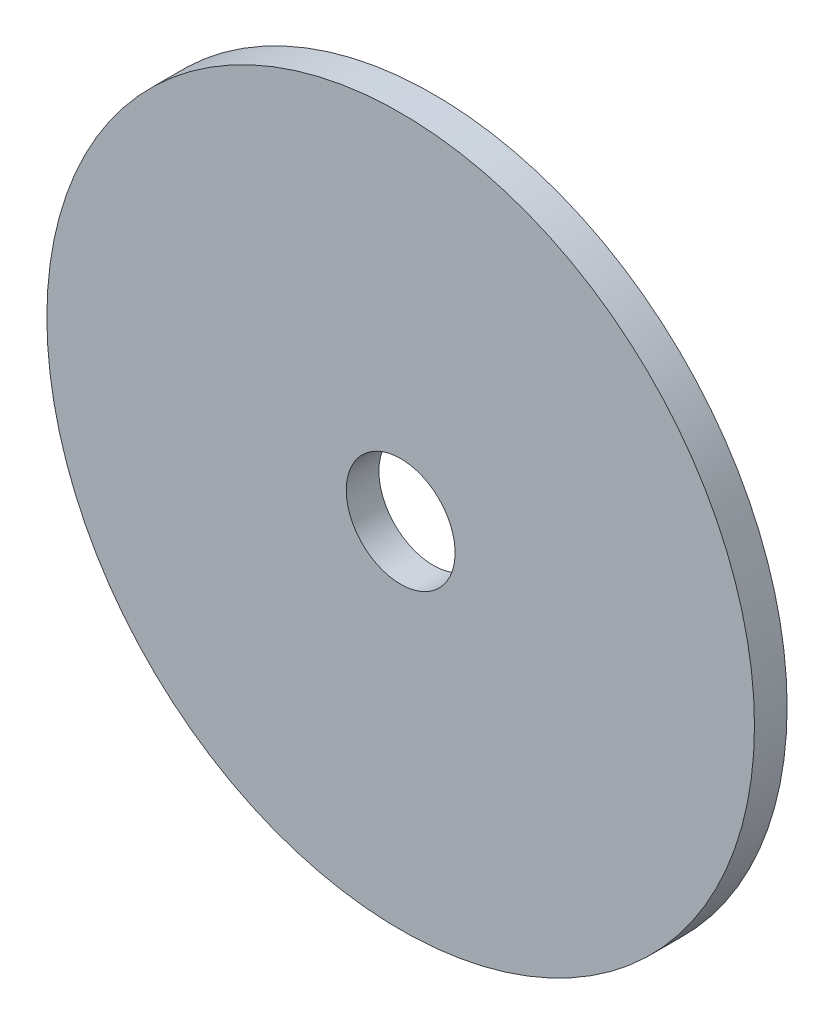
ISO-10303-21;
HEADER;
FILE_DESCRIPTION(('STEP AP214'),'2;1');
FILE_NAME('part.step','',(''),(''),'','','');
FILE_SCHEMA(('AUTOMOTIVE_DESIGN { 1 0 10303 214 1 1 1 1 }'));
ENDSEC;
DATA;
#1=APPLICATION_CONTEXT('core data for automotive mechanical design processes');
#2=APPLICATION_PROTOCOL_DEFINITION('international standard','automotive_design',2000,#1);
#3=PRODUCT_CONTEXT('',#1,'mechanical');
#4=PRODUCT('Part','Part','',(#3));
#5=PRODUCT_RELATED_PRODUCT_CATEGORY('part','',(#4));
#6=PRODUCT_DEFINITION_FORMATION('','',#4);
#7=PRODUCT_DEFINITION_CONTEXT('part definition',#1,'design');
#8=PRODUCT_DEFINITION('design','',#6,#7);
#9=PRODUCT_DEFINITION_SHAPE('','',#8);
#10=(LENGTH_UNIT() NAMED_UNIT(*) SI_UNIT(.MILLI.,.METRE.));
#11=(NAMED_UNIT(*) PLANE_ANGLE_UNIT() SI_UNIT($,.RADIAN.));
#12=(NAMED_UNIT(*) SI_UNIT($,.STERADIAN.) SOLID_ANGLE_UNIT());
#13=UNCERTAINTY_MEASURE_WITH_UNIT(LENGTH_MEASURE(1.E-05),#10,'distance_accuracy_value','');
#14=(GEOMETRIC_REPRESENTATION_CONTEXT(3) GLOBAL_UNCERTAINTY_ASSIGNED_CONTEXT((#13)) GLOBAL_UNIT_ASSIGNED_CONTEXT((#10,
#11,#12)) REPRESENTATION_CONTEXT('',''));
#15=CARTESIAN_POINT('',(0.,0.,0.));
#16=DIRECTION('',(0.,0.,1.));
#17=DIRECTION('',(1.,0.,0.));
#18=AXIS2_PLACEMENT_3D('',#15,#16,#17);
#19=CARTESIAN_POINT('',(0.,0.,6.));
#20=DIRECTION('',(0.,0.,-1.));
#21=DIRECTION('',(-1.,0.,0.));
#22=AXIS2_PLACEMENT_3D('',#19,#20,#21);
#23=CYLINDRICAL_SURFACE('',#22,65.);
#24=CARTESIAN_POINT('',(0.,0.,6.));
#25=DIRECTION('',(0.,0.,1.));
#26=DIRECTION('',(1.,0.,0.));
#27=AXIS2_PLACEMENT_3D('',#24,#25,#26);
#28=CIRCLE('',#27,65.);
#29=CARTESIAN_POINT('',(65.,0.,6.));
#30=VERTEX_POINT('',#29);
#31=EDGE_CURVE('E10',#30,#30,#28,.T.);
#32=ORIENTED_EDGE('',*,*,#31,.F.);
#33=EDGE_LOOP('',(#32));
#34=FACE_BOUND('',#33,.T.);
#35=CARTESIAN_POINT('',(0.,0.,0.));
#36=DIRECTION('',(0.,0.,1.));
#37=DIRECTION('',(1.,0.,0.));
#38=AXIS2_PLACEMENT_3D('',#35,#36,#37);
#39=CIRCLE('',#38,65.);
#40=CARTESIAN_POINT('',(65.,0.,0.));
#41=VERTEX_POINT('',#40);
#42=EDGE_CURVE('E34',#41,#41,#39,.T.);
#43=ORIENTED_EDGE('',*,*,#42,.T.);
#44=EDGE_LOOP('',(#43));
#45=FACE_BOUND('',#44,.T.);
#46=ADVANCED_FACE('F31',(#34,#45),#23,.T.);
#47=CARTESIAN_POINT('',(0.,0.,6.));
#48=DIRECTION('',(0.,0.,1.));
#49=DIRECTION('',(1.,0.,0.));
#50=AXIS2_PLACEMENT_3D('',#47,#48,#49);
#51=PLANE('',#50);
#52=CARTESIAN_POINT('',(0.,0.,6.));
#53=DIRECTION('',(0.,0.,-1.));
#54=DIRECTION('',(-1.,0.,0.));
#55=AXIS2_PLACEMENT_3D('',#52,#53,#54);
#56=CIRCLE('',#55,10.);
#57=CARTESIAN_POINT('',(-10.,0.,6.));
#58=VERTEX_POINT('',#57);
#59=EDGE_CURVE('E41',#58,#58,#56,.T.);
#60=ORIENTED_EDGE('',*,*,#59,.T.);
#61=EDGE_LOOP('',(#60));
#62=FACE_BOUND('',#61,.T.);
#63=ORIENTED_EDGE('',*,*,#31,.T.);
#64=EDGE_LOOP('',(#63));
#65=FACE_BOUND('',#64,.T.);
#66=ADVANCED_FACE('F49',(#62,#65),#51,.T.);
#67=CARTESIAN_POINT('',(0.,0.,0.));
#68=DIRECTION('',(0.,0.,1.));
#69=DIRECTION('',(1.,0.,0.));
#70=AXIS2_PLACEMENT_3D('',#67,#68,#69);
#71=PLANE('',#70);
#72=CARTESIAN_POINT('',(0.,0.,0.));
#73=DIRECTION('',(0.,0.,-1.));
#74=DIRECTION('',(-1.,0.,0.));
#75=AXIS2_PLACEMENT_3D('',#72,#73,#74);
#76=CIRCLE('',#75,10.);
#77=CARTESIAN_POINT('',(-10.,0.,0.));
#78=VERTEX_POINT('',#77);
#79=EDGE_CURVE('E43',#78,#78,#76,.T.);
#80=ORIENTED_EDGE('',*,*,#79,.F.);
#81=EDGE_LOOP('',(#80));
#82=FACE_BOUND('',#81,.T.);
#83=ORIENTED_EDGE('',*,*,#42,.F.);
#84=EDGE_LOOP('',(#83));
#85=FACE_BOUND('',#84,.T.);
#86=ADVANCED_FACE('F54',(#82,#85),#71,.F.);
#87=CARTESIAN_POINT('',(0.,0.,6.));
#88=DIRECTION('',(0.,0.,-1.));
#89=DIRECTION('',(-1.,0.,0.));
#90=AXIS2_PLACEMENT_3D('',#87,#88,#89);
#91=CYLINDRICAL_SURFACE('',#90,10.);
#92=ORIENTED_EDGE('',*,*,#59,.F.);
#93=EDGE_LOOP('',(#92));
#94=FACE_BOUND('',#93,.T.);
#95=ORIENTED_EDGE('',*,*,#79,.T.);
#96=EDGE_LOOP('',(#95));
#97=FACE_BOUND('',#96,.T.);
#98=ADVANCED_FACE('F51',(#94,#97),#91,.F.);
#99=CLOSED_SHELL('',(#46,#66,#86,#98));
#100=MANIFOLD_SOLID_BREP('B2',#99);
#101=ADVANCED_BREP_SHAPE_REPRESENTATION('',(#18,#100),#14);
#102=SHAPE_DEFINITION_REPRESENTATION(#9,#101);
ENDSEC;
END-ISO-10303-21;
